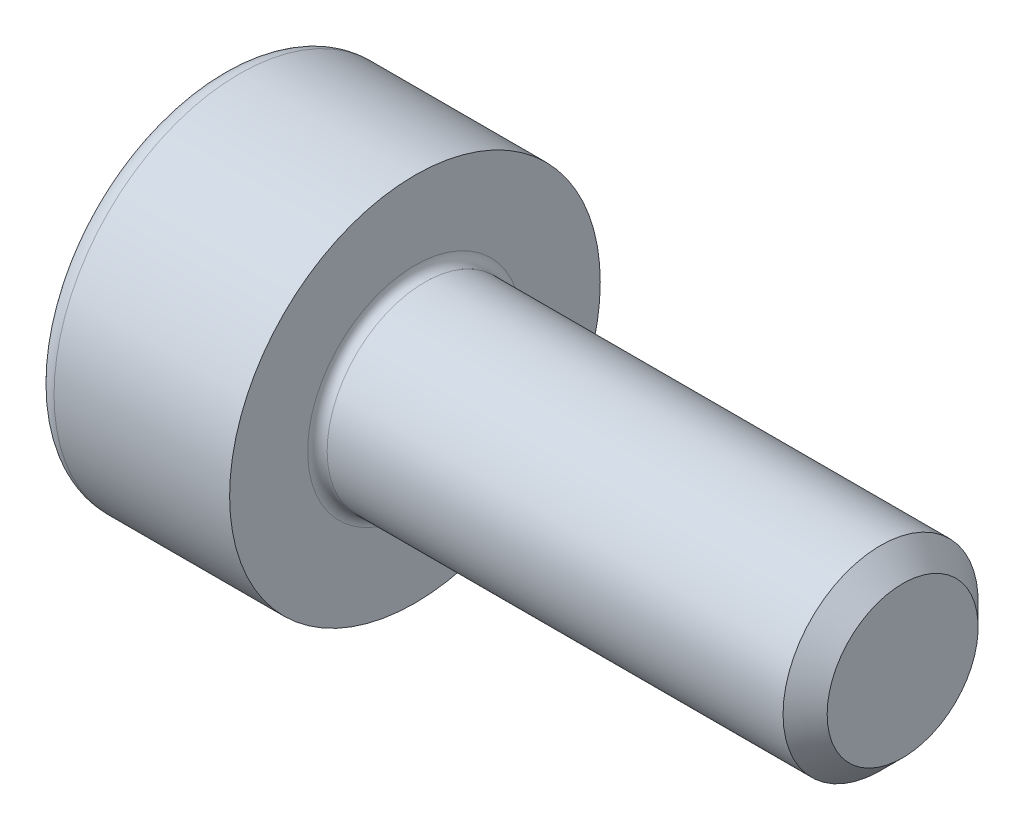
ISO-10303-21;
HEADER;
FILE_DESCRIPTION(('STEP AP214'),'2;1');
FILE_NAME('part.step','',(''),(''),'','','');
FILE_SCHEMA(('AUTOMOTIVE_DESIGN { 1 0 10303 214 1 1 1 1 }'));
ENDSEC;
DATA;
#1=APPLICATION_CONTEXT('core data for automotive mechanical design processes');
#2=APPLICATION_PROTOCOL_DEFINITION('international standard','automotive_design',2000,#1);
#3=PRODUCT_CONTEXT('',#1,'mechanical');
#4=PRODUCT('Part','Part','',(#3));
#5=PRODUCT_RELATED_PRODUCT_CATEGORY('part','',(#4));
#6=PRODUCT_DEFINITION_FORMATION('','',#4);
#7=PRODUCT_DEFINITION_CONTEXT('part definition',#1,'design');
#8=PRODUCT_DEFINITION('design','',#6,#7);
#9=PRODUCT_DEFINITION_SHAPE('','',#8);
#10=(LENGTH_UNIT() NAMED_UNIT(*) SI_UNIT(.MILLI.,.METRE.));
#11=(NAMED_UNIT(*) PLANE_ANGLE_UNIT() SI_UNIT($,.RADIAN.));
#12=(NAMED_UNIT(*) SI_UNIT($,.STERADIAN.) SOLID_ANGLE_UNIT());
#13=UNCERTAINTY_MEASURE_WITH_UNIT(LENGTH_MEASURE(1.E-05),#10,'distance_accuracy_value','');
#14=(GEOMETRIC_REPRESENTATION_CONTEXT(3) GLOBAL_UNCERTAINTY_ASSIGNED_CONTEXT((#13)) GLOBAL_UNIT_ASSIGNED_CONTEXT((#10,
#11,#12)) REPRESENTATION_CONTEXT('',''));
#15=CARTESIAN_POINT('',(0.,0.,0.));
#16=DIRECTION('',(0.,0.,1.));
#17=DIRECTION('',(1.,0.,0.));
#18=AXIS2_PLACEMENT_3D('',#15,#16,#17);
#19=CARTESIAN_POINT('',(0.,0.,0.));
#20=DIRECTION('',(-1.,0.,0.));
#21=DIRECTION('',(0.,0.,1.));
#22=AXIS2_PLACEMENT_3D('',#19,#20,#21);
#23=PLANE('',#22);
#24=DIRECTION('',(0.,-0.499999999999998,0.86602540378444));
#25=VECTOR('',#24,1.);
#26=CARTESIAN_POINT('',(0.,0.877572409168225,0.));
#27=LINE('',#26,#25);
#28=CARTESIAN_POINT('',(0.,0.877572409168225,0.));
#29=VERTEX_POINT('',#28);
#30=CARTESIAN_POINT('',(0.,0.438786204584111,0.759999999999998));
#31=VERTEX_POINT('',#30);
#32=EDGE_CURVE('E259',#29,#31,#27,.T.);
#33=ORIENTED_EDGE('',*,*,#32,.T.);
#34=DIRECTION('',(0.,1.,0.));
#35=VECTOR('',#34,1.);
#36=CARTESIAN_POINT('',(0.,-0.43878620458412,0.759999999999999));
#37=LINE('',#36,#35);
#38=CARTESIAN_POINT('',(0.,-0.43878620458412,0.759999999999999));
#39=VERTEX_POINT('',#38);
#40=EDGE_CURVE('E131',#39,#31,#37,.T.);
#41=ORIENTED_EDGE('',*,*,#40,.F.);
#42=DIRECTION('',(0.,-0.500000000000001,-0.866025403784438));
#43=VECTOR('',#42,1.);
#44=CARTESIAN_POINT('',(0.,-0.43878620458412,0.759999999999999));
#45=LINE('',#44,#43);
#46=CARTESIAN_POINT('',(0.,-0.877572409168236,0.));
#47=VERTEX_POINT('',#46);
#48=EDGE_CURVE('E262',#39,#47,#45,.T.);
#49=ORIENTED_EDGE('',*,*,#48,.T.);
#50=DIRECTION('',(0.,0.499999999999998,-0.86602540378444));
#51=VECTOR('',#50,1.);
#52=CARTESIAN_POINT('',(0.,-0.877572409168236,0.));
#53=LINE('',#52,#51);
#54=CARTESIAN_POINT('',(0.,-0.438786204584123,-0.760000000000001));
#55=VERTEX_POINT('',#54);
#56=EDGE_CURVE('E265',#47,#55,#53,.T.);
#57=ORIENTED_EDGE('',*,*,#56,.T.);
#58=DIRECTION('',(0.,-1.,0.));
#59=VECTOR('',#58,1.);
#60=CARTESIAN_POINT('',(0.,0.438786204584108,-0.760000000000002));
#61=LINE('',#60,#59);
#62=CARTESIAN_POINT('',(0.,0.438786204584108,-0.760000000000002));
#63=VERTEX_POINT('',#62);
#64=EDGE_CURVE('E268',#63,#55,#61,.T.);
#65=ORIENTED_EDGE('',*,*,#64,.F.);
#66=DIRECTION('',(0.,-0.500000000000001,-0.866025403784438));
#67=VECTOR('',#66,1.);
#68=CARTESIAN_POINT('',(0.,0.877572409168225,0.));
#69=LINE('',#68,#67);
#70=EDGE_CURVE('E126',#29,#63,#69,.T.);
#71=ORIENTED_EDGE('',*,*,#70,.F.);
#72=EDGE_LOOP('',(#33,#41,#49,#57,#65,#71));
#73=FACE_BOUND('',#72,.T.);
#74=CARTESIAN_POINT('',(0.,0.,0.));
#75=DIRECTION('',(-1.,0.,0.));
#76=DIRECTION('',(0.,0.,1.));
#77=AXIS2_PLACEMENT_3D('',#74,#75,#76);
#78=CIRCLE('',#77,1.7);
#79=CARTESIAN_POINT('',(0.,0.,1.7));
#80=VERTEX_POINT('',#79);
#81=EDGE_CURVE('E43',#80,#80,#78,.T.);
#82=ORIENTED_EDGE('',*,*,#81,.T.);
#83=EDGE_LOOP('',(#82));
#84=FACE_BOUND('',#83,.T.);
#85=ADVANCED_FACE('F35',(#73,#84),#23,.T.);
#86=CARTESIAN_POINT('',(-31.75,0.,0.));
#87=DIRECTION('',(-1.,0.,0.));
#88=DIRECTION('',(0.,0.,1.));
#89=AXIS2_PLACEMENT_3D('',#86,#87,#88);
#90=CYLINDRICAL_SURFACE('',#89,1.9);
#91=CARTESIAN_POINT('',(0.199999999999999,0.,0.));
#92=DIRECTION('',(-1.,0.,0.));
#93=DIRECTION('',(0.,0.,1.));
#94=AXIS2_PLACEMENT_3D('',#91,#92,#93);
#95=CIRCLE('',#94,1.9);
#96=CARTESIAN_POINT('',(0.199999999999999,0.,1.9));
#97=VERTEX_POINT('',#96);
#98=EDGE_CURVE('E11',#97,#97,#95,.F.);
#99=ORIENTED_EDGE('',*,*,#98,.T.);
#100=EDGE_LOOP('',(#99));
#101=FACE_BOUND('',#100,.T.);
#102=CARTESIAN_POINT('',(2.,0.,0.));
#103=DIRECTION('',(-1.,0.,0.));
#104=DIRECTION('',(0.,0.,1.));
#105=AXIS2_PLACEMENT_3D('',#102,#103,#104);
#106=CIRCLE('',#105,1.9);
#107=CARTESIAN_POINT('',(2.,0.,1.9));
#108=VERTEX_POINT('',#107);
#109=EDGE_CURVE('E149',#108,#108,#106,.T.);
#110=ORIENTED_EDGE('',*,*,#109,.T.);
#111=EDGE_LOOP('',(#110));
#112=FACE_BOUND('',#111,.T.);
#113=ADVANCED_FACE('F173',(#101,#112),#90,.T.);
#114=CARTESIAN_POINT('',(2.,1.9,0.));
#115=DIRECTION('',(1.,0.,0.));
#116=DIRECTION('',(0.,0.,-1.));
#117=AXIS2_PLACEMENT_3D('',#114,#115,#116);
#118=PLANE('',#117);
#119=CARTESIAN_POINT('',(2.,0.,0.));
#120=DIRECTION('',(1.,0.,0.));
#121=DIRECTION('',(0.,0.,-1.));
#122=AXIS2_PLACEMENT_3D('',#119,#120,#121);
#123=CIRCLE('',#122,1.09999999999999);
#124=CARTESIAN_POINT('',(2.,0.,-1.09999999999999));
#125=VERTEX_POINT('',#124);
#126=EDGE_CURVE('E152',#125,#125,#123,.F.);
#127=ORIENTED_EDGE('',*,*,#126,.T.);
#128=EDGE_LOOP('',(#127));
#129=FACE_BOUND('',#128,.T.);
#130=ORIENTED_EDGE('',*,*,#109,.F.);
#131=EDGE_LOOP('',(#130));
#132=FACE_BOUND('',#131,.T.);
#133=ADVANCED_FACE('F179',(#129,#132),#118,.T.);
#134=CARTESIAN_POINT('',(-31.75,0.,0.));
#135=DIRECTION('',(-1.,0.,0.));
#136=DIRECTION('',(0.,0.,1.));
#137=AXIS2_PLACEMENT_3D('',#134,#135,#136);
#138=CYLINDRICAL_SURFACE('',#137,0.999999999999995);
#139=CARTESIAN_POINT('',(2.1,0.,0.));
#140=DIRECTION('',(1.,0.,0.));
#141=DIRECTION('',(0.,0.,-1.));
#142=AXIS2_PLACEMENT_3D('',#139,#140,#141);
#143=CIRCLE('',#142,0.999999999999995);
#144=CARTESIAN_POINT('',(2.1,0.,-0.999999999999995));
#145=VERTEX_POINT('',#144);
#146=EDGE_CURVE('E155',#145,#145,#143,.T.);
#147=ORIENTED_EDGE('',*,*,#146,.T.);
#148=EDGE_LOOP('',(#147));
#149=FACE_BOUND('',#148,.T.);
#150=CARTESIAN_POINT('',(6.77399999999999,0.,0.));
#151=DIRECTION('',(-1.,0.,0.));
#152=DIRECTION('',(0.,0.,1.));
#153=AXIS2_PLACEMENT_3D('',#150,#151,#152);
#154=CIRCLE('',#153,0.99999999999999);
#155=CARTESIAN_POINT('',(6.77399999999999,0.,0.99999999999999));
#156=VERTEX_POINT('',#155);
#157=EDGE_CURVE('E146',#156,#156,#154,.T.);
#158=ORIENTED_EDGE('',*,*,#157,.T.);
#159=EDGE_LOOP('',(#158));
#160=FACE_BOUND('',#159,.T.);
#161=ADVANCED_FACE('F185',(#149,#160),#138,.T.);
#162=CARTESIAN_POINT('',(7.,0.,0.));
#163=DIRECTION('',(-1.,0.,0.));
#164=DIRECTION('',(0.,0.,1.));
#165=AXIS2_PLACEMENT_3D('',#162,#163,#164);
#166=CONICAL_SURFACE('',#165,0.774,0.785398163397402);
#167=ORIENTED_EDGE('',*,*,#157,.F.);
#168=EDGE_LOOP('',(#167));
#169=FACE_BOUND('',#168,.T.);
#170=CARTESIAN_POINT('',(7.,0.,0.));
#171=DIRECTION('',(-1.,0.,0.));
#172=DIRECTION('',(0.,0.,1.));
#173=AXIS2_PLACEMENT_3D('',#170,#171,#172);
#174=CIRCLE('',#173,0.774);
#175=CARTESIAN_POINT('',(7.,0.,0.774));
#176=VERTEX_POINT('',#175);
#177=EDGE_CURVE('E142',#176,#176,#174,.T.);
#178=ORIENTED_EDGE('',*,*,#177,.T.);
#179=EDGE_LOOP('',(#178));
#180=FACE_BOUND('',#179,.T.);
#181=ADVANCED_FACE('F189',(#169,#180),#166,.T.);
#182=CARTESIAN_POINT('',(7.,0.774,0.));
#183=DIRECTION('',(1.,0.,0.));
#184=DIRECTION('',(0.,0.,-1.));
#185=AXIS2_PLACEMENT_3D('',#182,#183,#184);
#186=PLANE('',#185);
#187=ORIENTED_EDGE('',*,*,#177,.F.);
#188=EDGE_LOOP('',(#187));
#189=FACE_BOUND('',#188,.T.);
#190=ADVANCED_FACE('F169',(#189),#186,.T.);
#191=CARTESIAN_POINT('',(2.1,0.,0.));
#192=DIRECTION('',(1.,0.,0.));
#193=DIRECTION('',(0.,0.,-1.));
#194=AXIS2_PLACEMENT_3D('',#191,#192,#193);
#195=TOROIDAL_SURFACE('',#194,1.09999999999999,0.1);
#196=ORIENTED_EDGE('',*,*,#146,.F.);
#197=EDGE_LOOP('',(#196));
#198=FACE_BOUND('',#197,.T.);
#199=ORIENTED_EDGE('',*,*,#126,.F.);
#200=EDGE_LOOP('',(#199));
#201=FACE_BOUND('',#200,.T.);
#202=ADVANCED_FACE('F162',(#198,#201),#195,.F.);
#203=CARTESIAN_POINT('',(0.199999999999999,0.,0.));
#204=DIRECTION('',(-1.,0.,0.));
#205=DIRECTION('',(0.,0.,1.));
#206=AXIS2_PLACEMENT_3D('',#203,#204,#205);
#207=TOROIDAL_SURFACE('',#206,1.7,0.2);
#208=ORIENTED_EDGE('',*,*,#98,.F.);
#209=EDGE_LOOP('',(#208));
#210=FACE_BOUND('',#209,.T.);
#211=ORIENTED_EDGE('',*,*,#81,.F.);
#212=EDGE_LOOP('',(#211));
#213=FACE_BOUND('',#212,.T.);
#214=ADVANCED_FACE('F37',(#210,#213),#207,.T.);
#215=CARTESIAN_POINT('',(1.,0.877572409168225,0.));
#216=DIRECTION('',(0.,-0.86602540378444,-0.499999999999998));
#217=DIRECTION('',(0.,0.499999999999998,-0.86602540378444));
#218=AXIS2_PLACEMENT_3D('',#215,#216,#217);
#219=PLANE('',#218);
#220=ORIENTED_EDGE('',*,*,#32,.F.);
#221=DIRECTION('',(-1.,0.,0.));
#222=VECTOR('',#221,1.);
#223=CARTESIAN_POINT('',(1.,0.877572409168225,0.));
#224=LINE('',#223,#222);
#225=CARTESIAN_POINT('',(1.,0.877572409168225,0.));
#226=VERTEX_POINT('',#225);
#227=EDGE_CURVE('E249',#226,#29,#224,.T.);
#228=ORIENTED_EDGE('',*,*,#227,.F.);
#229=DIRECTION('',(0.,-0.499999999999998,0.86602540378444));
#230=VECTOR('',#229,1.);
#231=CARTESIAN_POINT('',(1.,0.877572409168225,0.));
#232=LINE('',#231,#230);
#233=CARTESIAN_POINT('',(1.,0.658179306876169,0.379999999999996));
#234=VERTEX_POINT('',#233);
#235=EDGE_CURVE('E118',#226,#234,#232,.T.);
#236=ORIENTED_EDGE('',*,*,#235,.T.);
#237=CARTESIAN_POINT('',(1.,0.438786204584111,0.759999999999998));
#238=VERTEX_POINT('',#237);
#239=EDGE_CURVE('E109',#234,#238,#232,.T.);
#240=ORIENTED_EDGE('',*,*,#239,.T.);
#241=DIRECTION('',(-1.,0.,0.));
#242=VECTOR('',#241,1.);
#243=CARTESIAN_POINT('',(1.,0.438786204584111,0.759999999999998));
#244=LINE('',#243,#242);
#245=EDGE_CURVE('E123',#238,#31,#244,.T.);
#246=ORIENTED_EDGE('',*,*,#245,.T.);
#247=EDGE_LOOP('',(#220,#228,#236,#240,#246));
#248=FACE_BOUND('',#247,.T.);
#249=ADVANCED_FACE('F122',(#248),#219,.T.);
#250=CARTESIAN_POINT('',(1.,-0.43878620458412,0.759999999999999));
#251=DIRECTION('',(0.,0.,1.));
#252=DIRECTION('',(0.,-1.,0.));
#253=AXIS2_PLACEMENT_3D('',#250,#251,#252);
#254=PLANE('',#253);
#255=ORIENTED_EDGE('',*,*,#40,.T.);
#256=ORIENTED_EDGE('',*,*,#245,.F.);
#257=DIRECTION('',(0.,1.,0.));
#258=VECTOR('',#257,1.);
#259=CARTESIAN_POINT('',(1.,-0.43878620458412,0.759999999999999));
#260=LINE('',#259,#258);
#261=CARTESIAN_POINT('',(1.,0.,0.759999999999998));
#262=VERTEX_POINT('',#261);
#263=EDGE_CURVE('E106',#262,#238,#260,.T.);
#264=ORIENTED_EDGE('',*,*,#263,.F.);
#265=CARTESIAN_POINT('',(1.,-0.43878620458412,0.759999999999999));
#266=VERTEX_POINT('',#265);
#267=EDGE_CURVE('E117',#266,#262,#260,.T.);
#268=ORIENTED_EDGE('',*,*,#267,.F.);
#269=DIRECTION('',(-1.,0.,0.));
#270=VECTOR('',#269,1.);
#271=CARTESIAN_POINT('',(1.,-0.43878620458412,0.759999999999999));
#272=LINE('',#271,#270);
#273=EDGE_CURVE('E133',#266,#39,#272,.T.);
#274=ORIENTED_EDGE('',*,*,#273,.T.);
#275=EDGE_LOOP('',(#255,#256,#264,#268,#274));
#276=FACE_BOUND('',#275,.T.);
#277=ADVANCED_FACE('F128',(#276),#254,.F.);
#278=CARTESIAN_POINT('',(1.,-0.43878620458412,0.759999999999999));
#279=DIRECTION('',(0.,0.866025403784438,-0.500000000000001));
#280=DIRECTION('',(0.,0.500000000000001,0.866025403784438));
#281=AXIS2_PLACEMENT_3D('',#278,#279,#280);
#282=PLANE('',#281);
#283=ORIENTED_EDGE('',*,*,#48,.F.);
#284=ORIENTED_EDGE('',*,*,#273,.F.);
#285=DIRECTION('',(0.,-0.500000000000001,-0.866025403784438));
#286=VECTOR('',#285,1.);
#287=CARTESIAN_POINT('',(1.,-0.43878620458412,0.759999999999999));
#288=LINE('',#287,#286);
#289=CARTESIAN_POINT('',(1.,-0.658179306876176,0.380000000000003));
#290=VERTEX_POINT('',#289);
#291=EDGE_CURVE('E288',#266,#290,#288,.T.);
#292=ORIENTED_EDGE('',*,*,#291,.T.);
#293=CARTESIAN_POINT('',(1.,-0.877572409168236,0.));
#294=VERTEX_POINT('',#293);
#295=EDGE_CURVE('E277',#290,#294,#288,.T.);
#296=ORIENTED_EDGE('',*,*,#295,.T.);
#297=DIRECTION('',(-1.,0.,0.));
#298=VECTOR('',#297,1.);
#299=CARTESIAN_POINT('',(1.,-0.877572409168236,0.));
#300=LINE('',#299,#298);
#301=EDGE_CURVE('E138',#294,#47,#300,.T.);
#302=ORIENTED_EDGE('',*,*,#301,.T.);
#303=EDGE_LOOP('',(#283,#284,#292,#296,#302));
#304=FACE_BOUND('',#303,.T.);
#305=ADVANCED_FACE('F203',(#304),#282,.T.);
#306=CARTESIAN_POINT('',(1.,-0.877572409168236,0.));
#307=DIRECTION('',(0.,0.86602540378444,0.499999999999998));
#308=DIRECTION('',(0.,-0.499999999999998,0.86602540378444));
#309=AXIS2_PLACEMENT_3D('',#306,#307,#308);
#310=PLANE('',#309);
#311=ORIENTED_EDGE('',*,*,#56,.F.);
#312=ORIENTED_EDGE('',*,*,#301,.F.);
#313=DIRECTION('',(0.,0.499999999999998,-0.86602540378444));
#314=VECTOR('',#313,1.);
#315=CARTESIAN_POINT('',(1.,-0.877572409168236,0.));
#316=LINE('',#315,#314);
#317=CARTESIAN_POINT('',(1.,-0.658179306876179,-0.380000000000001));
#318=VERTEX_POINT('',#317);
#319=EDGE_CURVE('E255',#294,#318,#316,.T.);
#320=ORIENTED_EDGE('',*,*,#319,.T.);
#321=CARTESIAN_POINT('',(1.,-0.438786204584123,-0.760000000000001));
#322=VERTEX_POINT('',#321);
#323=EDGE_CURVE('E287',#318,#322,#316,.T.);
#324=ORIENTED_EDGE('',*,*,#323,.T.);
#325=DIRECTION('',(-1.,0.,0.));
#326=VECTOR('',#325,1.);
#327=CARTESIAN_POINT('',(1.,-0.438786204584123,-0.760000000000001));
#328=LINE('',#327,#326);
#329=EDGE_CURVE('E248',#322,#55,#328,.T.);
#330=ORIENTED_EDGE('',*,*,#329,.T.);
#331=EDGE_LOOP('',(#311,#312,#320,#324,#330));
#332=FACE_BOUND('',#331,.T.);
#333=ADVANCED_FACE('F206',(#332),#310,.T.);
#334=CARTESIAN_POINT('',(1.,0.438786204584108,-0.760000000000002));
#335=DIRECTION('',(0.,0.,-1.));
#336=DIRECTION('',(0.,1.,0.));
#337=AXIS2_PLACEMENT_3D('',#334,#335,#336);
#338=PLANE('',#337);
#339=ORIENTED_EDGE('',*,*,#64,.T.);
#340=ORIENTED_EDGE('',*,*,#329,.F.);
#341=DIRECTION('',(0.,-1.,0.));
#342=VECTOR('',#341,1.);
#343=CARTESIAN_POINT('',(1.,0.438786204584108,-0.760000000000002));
#344=LINE('',#343,#342);
#345=CARTESIAN_POINT('',(1.,0.,-0.76));
#346=VERTEX_POINT('',#345);
#347=EDGE_CURVE('E252',#346,#322,#344,.T.);
#348=ORIENTED_EDGE('',*,*,#347,.F.);
#349=CARTESIAN_POINT('',(1.,0.438786204584108,-0.760000000000002));
#350=VERTEX_POINT('',#349);
#351=EDGE_CURVE('E50',#350,#346,#344,.T.);
#352=ORIENTED_EDGE('',*,*,#351,.F.);
#353=DIRECTION('',(-1.,0.,0.));
#354=VECTOR('',#353,1.);
#355=CARTESIAN_POINT('',(1.,0.438786204584108,-0.760000000000002));
#356=LINE('',#355,#354);
#357=EDGE_CURVE('E245',#350,#63,#356,.T.);
#358=ORIENTED_EDGE('',*,*,#357,.T.);
#359=EDGE_LOOP('',(#339,#340,#348,#352,#358));
#360=FACE_BOUND('',#359,.T.);
#361=ADVANCED_FACE('F210',(#360),#338,.F.);
#362=CARTESIAN_POINT('',(1.,0.877572409168225,0.));
#363=DIRECTION('',(0.,0.866025403784438,-0.500000000000001));
#364=DIRECTION('',(0.,0.500000000000001,0.866025403784438));
#365=AXIS2_PLACEMENT_3D('',#362,#363,#364);
#366=PLANE('',#365);
#367=ORIENTED_EDGE('',*,*,#70,.T.);
#368=ORIENTED_EDGE('',*,*,#357,.F.);
#369=DIRECTION('',(0.,-0.500000000000001,-0.866025403784438));
#370=VECTOR('',#369,1.);
#371=CARTESIAN_POINT('',(1.,0.877572409168225,0.));
#372=LINE('',#371,#370);
#373=CARTESIAN_POINT('',(1.,0.658179306876168,-0.379999999999998));
#374=VERTEX_POINT('',#373);
#375=EDGE_CURVE('E235',#374,#350,#372,.T.);
#376=ORIENTED_EDGE('',*,*,#375,.F.);
#377=EDGE_CURVE('E241',#226,#374,#372,.T.);
#378=ORIENTED_EDGE('',*,*,#377,.F.);
#379=ORIENTED_EDGE('',*,*,#227,.T.);
#380=EDGE_LOOP('',(#367,#368,#376,#378,#379));
#381=FACE_BOUND('',#380,.T.);
#382=ADVANCED_FACE('F214',(#381),#366,.F.);
#383=CARTESIAN_POINT('',(1.,1.31635861375234,-0.760000000000003));
#384=DIRECTION('',(1.,0.,0.));
#385=DIRECTION('',(0.,0.,-1.));
#386=AXIS2_PLACEMENT_3D('',#383,#384,#385);
#387=PLANE('',#386);
#388=ORIENTED_EDGE('',*,*,#347,.T.);
#389=ORIENTED_EDGE('',*,*,#323,.F.);
#390=CARTESIAN_POINT('',(1.,0.,0.));
#391=DIRECTION('',(-1.,0.,0.));
#392=DIRECTION('',(0.,0.,1.));
#393=AXIS2_PLACEMENT_3D('',#390,#391,#392);
#394=CIRCLE('',#393,0.76);
#395=EDGE_CURVE('E283',#346,#318,#394,.T.);
#396=ORIENTED_EDGE('',*,*,#395,.F.);
#397=EDGE_LOOP('',(#388,#389,#396));
#398=FACE_BOUND('',#397,.T.);
#399=ADVANCED_FACE('F218',(#398),#387,.F.);
#400=ORIENTED_EDGE('',*,*,#319,.F.);
#401=ORIENTED_EDGE('',*,*,#295,.F.);
#402=EDGE_CURVE('E136',#318,#290,#394,.T.);
#403=ORIENTED_EDGE('',*,*,#402,.F.);
#404=EDGE_LOOP('',(#400,#401,#403));
#405=FACE_BOUND('',#404,.T.);
#406=ADVANCED_FACE('F221',(#405),#387,.F.);
#407=ORIENTED_EDGE('',*,*,#291,.F.);
#408=ORIENTED_EDGE('',*,*,#267,.T.);
#409=EDGE_CURVE('E132',#290,#262,#394,.T.);
#410=ORIENTED_EDGE('',*,*,#409,.F.);
#411=EDGE_LOOP('',(#407,#408,#410));
#412=FACE_BOUND('',#411,.T.);
#413=ADVANCED_FACE('F226',(#412),#387,.F.);
#414=ORIENTED_EDGE('',*,*,#263,.T.);
#415=ORIENTED_EDGE('',*,*,#239,.F.);
#416=EDGE_CURVE('E112',#262,#234,#394,.T.);
#417=ORIENTED_EDGE('',*,*,#416,.F.);
#418=EDGE_LOOP('',(#414,#415,#417));
#419=FACE_BOUND('',#418,.T.);
#420=ADVANCED_FACE('F108',(#419),#387,.F.);
#421=ORIENTED_EDGE('',*,*,#235,.F.);
#422=ORIENTED_EDGE('',*,*,#377,.T.);
#423=EDGE_CURVE('E143',#234,#374,#394,.T.);
#424=ORIENTED_EDGE('',*,*,#423,.F.);
#425=EDGE_LOOP('',(#421,#422,#424));
#426=FACE_BOUND('',#425,.T.);
#427=ADVANCED_FACE('F229',(#426),#387,.F.);
#428=ORIENTED_EDGE('',*,*,#375,.T.);
#429=ORIENTED_EDGE('',*,*,#351,.T.);
#430=EDGE_CURVE('E238',#374,#346,#394,.T.);
#431=ORIENTED_EDGE('',*,*,#430,.F.);
#432=EDGE_LOOP('',(#428,#429,#431));
#433=FACE_BOUND('',#432,.T.);
#434=ADVANCED_FACE('F199',(#433),#387,.F.);
#435=CARTESIAN_POINT('',(1.,0.,0.));
#436=DIRECTION('',(-1.,0.,0.));
#437=DIRECTION('',(0.,0.,1.));
#438=AXIS2_PLACEMENT_3D('',#435,#436,#437);
#439=CONICAL_SURFACE('',#438,0.76,1.0471975511966);
#440=CARTESIAN_POINT('',(1.43878620458412,0.,0.));
#441=VERTEX_POINT('',#440);
#442=VERTEX_LOOP('',#441);
#443=FACE_BOUND('',#442,.T.);
#444=ORIENTED_EDGE('',*,*,#416,.T.);
#445=ORIENTED_EDGE('',*,*,#423,.T.);
#446=ORIENTED_EDGE('',*,*,#430,.T.);
#447=ORIENTED_EDGE('',*,*,#395,.T.);
#448=ORIENTED_EDGE('',*,*,#402,.T.);
#449=ORIENTED_EDGE('',*,*,#409,.T.);
#450=EDGE_LOOP('',(#444,#445,#446,#447,#448,#449));
#451=FACE_BOUND('',#450,.T.);
#452=ADVANCED_FACE('F197',(#443,#451),#439,.F.);
#453=CLOSED_SHELL('',(#85,#113,#133,#161,#181,#190,#202,#214,#249,#277,#305,#333,#361,#382,#399,
#406,#413,#420,#427,#434,#452));
#454=MANIFOLD_SOLID_BREP('B2',#453);
#455=ADVANCED_BREP_SHAPE_REPRESENTATION('',(#18,#454),#14);
#456=SHAPE_DEFINITION_REPRESENTATION(#9,#455);
ENDSEC;
END-ISO-10303-21;
